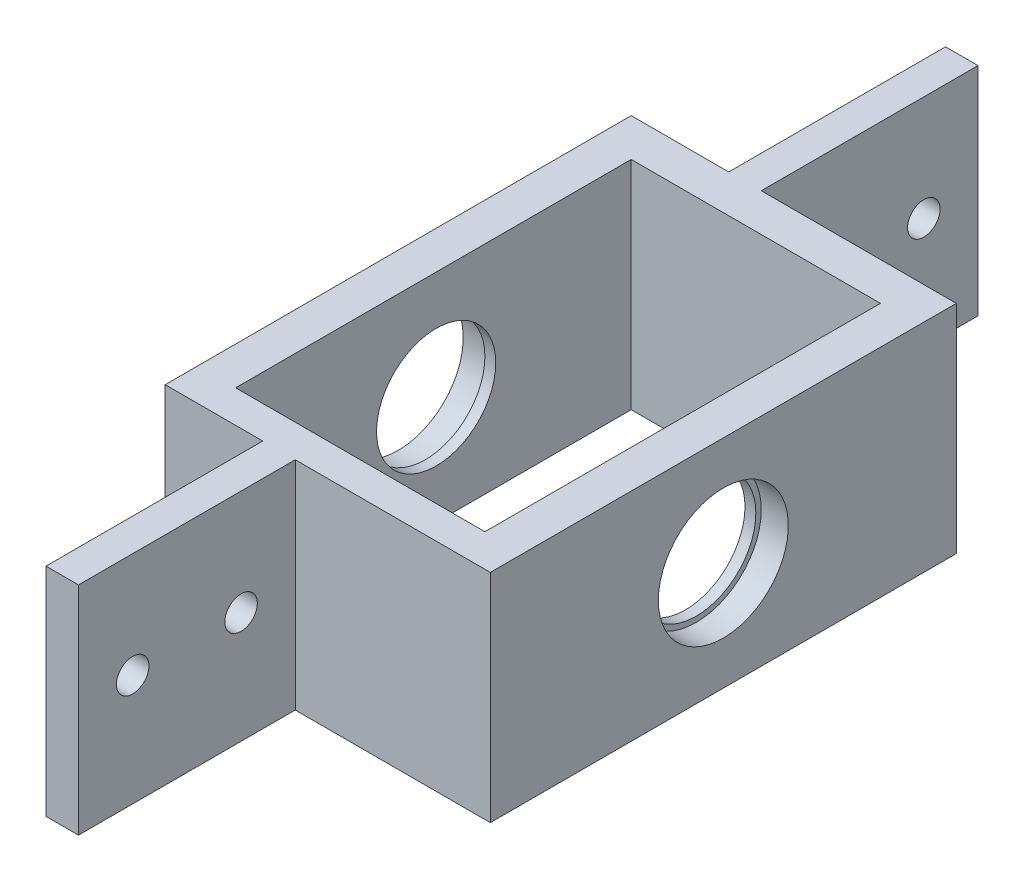
ISO-10303-21;
HEADER;
FILE_DESCRIPTION(('STEP AP214'),'2;1');
FILE_NAME('part.step','',(''),(''),'','','');
FILE_SCHEMA(('AUTOMOTIVE_DESIGN { 1 0 10303 214 1 1 1 1 }'));
ENDSEC;
DATA;
#1=APPLICATION_CONTEXT('core data for automotive mechanical design processes');
#2=APPLICATION_PROTOCOL_DEFINITION('international standard','automotive_design',2000,#1);
#3=PRODUCT_CONTEXT('',#1,'mechanical');
#4=PRODUCT('Part','Part','',(#3));
#5=PRODUCT_RELATED_PRODUCT_CATEGORY('part','',(#4));
#6=PRODUCT_DEFINITION_FORMATION('','',#4);
#7=PRODUCT_DEFINITION_CONTEXT('part definition',#1,'design');
#8=PRODUCT_DEFINITION('design','',#6,#7);
#9=PRODUCT_DEFINITION_SHAPE('','',#8);
#10=(LENGTH_UNIT() NAMED_UNIT(*) SI_UNIT(.MILLI.,.METRE.));
#11=(NAMED_UNIT(*) PLANE_ANGLE_UNIT() SI_UNIT($,.RADIAN.));
#12=(NAMED_UNIT(*) SI_UNIT($,.STERADIAN.) SOLID_ANGLE_UNIT());
#13=UNCERTAINTY_MEASURE_WITH_UNIT(LENGTH_MEASURE(1.E-05),#10,'distance_accuracy_value','');
#14=(GEOMETRIC_REPRESENTATION_CONTEXT(3) GLOBAL_UNCERTAINTY_ASSIGNED_CONTEXT((#13)) GLOBAL_UNIT_ASSIGNED_CONTEXT((#10,
#11,#12)) REPRESENTATION_CONTEXT('',''));
#15=CARTESIAN_POINT('',(0.,0.,0.));
#16=DIRECTION('',(0.,0.,1.));
#17=DIRECTION('',(1.,0.,0.));
#18=AXIS2_PLACEMENT_3D('',#15,#16,#17);
#19=CARTESIAN_POINT('',(0.,0.,3.));
#20=DIRECTION('',(0.,0.,1.));
#21=DIRECTION('',(1.,0.,0.));
#22=AXIS2_PLACEMENT_3D('',#19,#20,#21);
#23=PLANE('',#22);
#24=DIRECTION('',(1.,0.,0.));
#25=VECTOR('',#24,1.);
#26=CARTESIAN_POINT('',(0.,-10.1457513110646,3.));
#27=LINE('',#26,#25);
#28=CARTESIAN_POINT('',(-83.,-10.1457513110646,3.));
#29=VERTEX_POINT('',#28);
#30=CARTESIAN_POINT('',(-74.,-10.1457513110646,3.00000000000001));
#31=VERTEX_POINT('',#30);
#32=EDGE_CURVE('E281',#29,#31,#27,.T.);
#33=ORIENTED_EDGE('',*,*,#32,.T.);
#34=DIRECTION('',(0.,1.,0.));
#35=VECTOR('',#34,1.);
#36=CARTESIAN_POINT('',(-74.,-10.1457513110646,3.00000000000001));
#37=LINE('',#36,#35);
#38=CARTESIAN_POINT('',(-74.,9.85424868893541,3.));
#39=VERTEX_POINT('',#38);
#40=EDGE_CURVE('E167',#31,#39,#37,.T.);
#41=ORIENTED_EDGE('',*,*,#40,.T.);
#42=DIRECTION('',(-1.,0.,0.));
#43=VECTOR('',#42,1.);
#44=CARTESIAN_POINT('',(0.,9.85424868893541,3.));
#45=LINE('',#44,#43);
#46=CARTESIAN_POINT('',(-83.,9.85424868893541,3.));
#47=VERTEX_POINT('',#46);
#48=EDGE_CURVE('E286',#39,#47,#45,.T.);
#49=ORIENTED_EDGE('',*,*,#48,.T.);
#50=DIRECTION('',(0.,1.,0.));
#51=VECTOR('',#50,1.);
#52=CARTESIAN_POINT('',(-83.,0.,3.));
#53=LINE('',#52,#51);
#54=EDGE_CURVE('E290',#29,#47,#53,.T.);
#55=ORIENTED_EDGE('',*,*,#54,.F.);
#56=EDGE_LOOP('',(#33,#41,#49,#55));
#57=FACE_BOUND('',#56,.T.);
#58=ADVANCED_FACE('F37',(#57),#23,.T.);
#59=CARTESIAN_POINT('',(0.,0.,-40.));
#60=DIRECTION('',(0.,0.,1.));
#61=DIRECTION('',(1.,0.,0.));
#62=AXIS2_PLACEMENT_3D('',#59,#60,#61);
#63=PLANE('',#62);
#64=DIRECTION('',(0.,1.,0.));
#65=VECTOR('',#64,1.);
#66=CARTESIAN_POINT('',(-74.,-10.1457513110646,-40.));
#67=LINE('',#66,#65);
#68=CARTESIAN_POINT('',(-74.,-10.1457513110646,-40.));
#69=VERTEX_POINT('',#68);
#70=CARTESIAN_POINT('',(-74.,9.85424868893541,-40.));
#71=VERTEX_POINT('',#70);
#72=EDGE_CURVE('E202',#69,#71,#67,.T.);
#73=ORIENTED_EDGE('',*,*,#72,.F.);
#74=DIRECTION('',(1.,0.,0.));
#75=VECTOR('',#74,1.);
#76=CARTESIAN_POINT('',(0.,-10.1457513110646,-40.));
#77=LINE('',#76,#75);
#78=CARTESIAN_POINT('',(-83.,-10.1457513110646,-40.));
#79=VERTEX_POINT('',#78);
#80=EDGE_CURVE('E268',#79,#69,#77,.T.);
#81=ORIENTED_EDGE('',*,*,#80,.F.);
#82=DIRECTION('',(0.,1.,0.));
#83=VECTOR('',#82,1.);
#84=CARTESIAN_POINT('',(-83.,0.,-40.));
#85=LINE('',#84,#83);
#86=CARTESIAN_POINT('',(-83.,9.85424868893541,-40.));
#87=VERTEX_POINT('',#86);
#88=EDGE_CURVE('E254',#79,#87,#85,.T.);
#89=ORIENTED_EDGE('',*,*,#88,.T.);
#90=DIRECTION('',(-1.,0.,0.));
#91=VECTOR('',#90,1.);
#92=CARTESIAN_POINT('',(0.,9.85424868893541,-40.));
#93=LINE('',#92,#91);
#94=EDGE_CURVE('E267',#71,#87,#93,.T.);
#95=ORIENTED_EDGE('',*,*,#94,.F.);
#96=EDGE_LOOP('',(#73,#81,#89,#95));
#97=FACE_BOUND('',#96,.T.);
#98=ADVANCED_FACE('F338',(#97),#63,.F.);
#99=CARTESIAN_POINT('',(-56.5,0.,-40.));
#100=DIRECTION('',(-1.,0.,0.));
#101=DIRECTION('',(0.,0.,1.));
#102=AXIS2_PLACEMENT_3D('',#99,#100,#101);
#103=PLANE('',#102);
#104=CARTESIAN_POINT('',(-56.5,-0.145751311064588,-18.5));
#105=DIRECTION('',(1.,0.,0.));
#106=DIRECTION('',(0.,0.,-1.));
#107=AXIS2_PLACEMENT_3D('',#104,#105,#106);
#108=CIRCLE('',#107,5.5);
#109=CARTESIAN_POINT('',(-56.5,-0.145751311064588,-24.));
#110=VERTEX_POINT('',#109);
#111=EDGE_CURVE('E236',#110,#110,#108,.T.);
#112=ORIENTED_EDGE('',*,*,#111,.T.);
#113=EDGE_LOOP('',(#112));
#114=FACE_BOUND('',#113,.T.);
#115=DIRECTION('',(0.,0.,1.));
#116=VECTOR('',#115,1.);
#117=CARTESIAN_POINT('',(-56.5,9.85424868893541,-40.));
#118=LINE('',#117,#116);
#119=CARTESIAN_POINT('',(-56.5,9.85424868893541,-36.5));
#120=VERTEX_POINT('',#119);
#121=CARTESIAN_POINT('',(-56.5,9.85424868893541,0.));
#122=VERTEX_POINT('',#121);
#123=EDGE_CURVE('E274',#120,#122,#118,.T.);
#124=ORIENTED_EDGE('',*,*,#123,.F.);
#125=DIRECTION('',(0.,-1.,0.));
#126=VECTOR('',#125,1.);
#127=CARTESIAN_POINT('',(-56.5,9.85424868893541,-36.5));
#128=LINE('',#127,#126);
#129=CARTESIAN_POINT('',(-56.5,-10.1457513110646,-36.5));
#130=VERTEX_POINT('',#129);
#131=EDGE_CURVE('E224',#120,#130,#128,.T.);
#132=ORIENTED_EDGE('',*,*,#131,.T.);
#133=DIRECTION('',(0.,0.,1.));
#134=VECTOR('',#133,1.);
#135=CARTESIAN_POINT('',(-56.5,-10.1457513110646,-40.));
#136=LINE('',#135,#134);
#137=CARTESIAN_POINT('',(-56.5,-10.1457513110646,0.));
#138=VERTEX_POINT('',#137);
#139=EDGE_CURVE('E277',#130,#138,#136,.T.);
#140=ORIENTED_EDGE('',*,*,#139,.T.);
#141=DIRECTION('',(0.,-1.,0.));
#142=VECTOR('',#141,1.);
#143=CARTESIAN_POINT('',(-56.5,0.,0.));
#144=LINE('',#143,#142);
#145=EDGE_CURVE('E262',#122,#138,#144,.T.);
#146=ORIENTED_EDGE('',*,*,#145,.F.);
#147=EDGE_LOOP('',(#124,#132,#140,#146));
#148=FACE_BOUND('',#147,.T.);
#149=ADVANCED_FACE('F365',(#114,#148),#103,.T.);
#150=CARTESIAN_POINT('',(-79.5,0.,-40.));
#151=DIRECTION('',(-1.,0.,0.));
#152=DIRECTION('',(0.,0.,1.));
#153=AXIS2_PLACEMENT_3D('',#150,#151,#152);
#154=PLANE('',#153);
#155=CARTESIAN_POINT('',(-79.5,-0.145751311064588,-18.5));
#156=DIRECTION('',(1.,0.,0.));
#157=DIRECTION('',(0.,0.,-1.));
#158=AXIS2_PLACEMENT_3D('',#155,#156,#157);
#159=CIRCLE('',#158,5.5);
#160=CARTESIAN_POINT('',(-79.5,-0.145751311064588,-24.));
#161=VERTEX_POINT('',#160);
#162=EDGE_CURVE('E232',#161,#161,#159,.T.);
#163=ORIENTED_EDGE('',*,*,#162,.F.);
#164=EDGE_LOOP('',(#163));
#165=FACE_BOUND('',#164,.T.);
#166=DIRECTION('',(0.,-1.,0.));
#167=VECTOR('',#166,1.);
#168=CARTESIAN_POINT('',(-79.5,9.85424868893541,-36.5));
#169=LINE('',#168,#167);
#170=CARTESIAN_POINT('',(-79.5,9.85424868893541,-36.5));
#171=VERTEX_POINT('',#170);
#172=CARTESIAN_POINT('',(-79.5,-10.1457513110646,-36.5));
#173=VERTEX_POINT('',#172);
#174=EDGE_CURVE('E223',#171,#173,#169,.T.);
#175=ORIENTED_EDGE('',*,*,#174,.F.);
#176=DIRECTION('',(0.,0.,1.));
#177=VECTOR('',#176,1.);
#178=CARTESIAN_POINT('',(-79.5,9.85424868893541,-40.));
#179=LINE('',#178,#177);
#180=CARTESIAN_POINT('',(-79.5,9.85424868893541,0.));
#181=VERTEX_POINT('',#180);
#182=EDGE_CURVE('E260',#171,#181,#179,.T.);
#183=ORIENTED_EDGE('',*,*,#182,.T.);
#184=DIRECTION('',(0.,-1.,0.));
#185=VECTOR('',#184,1.);
#186=CARTESIAN_POINT('',(-79.5,0.,0.));
#187=LINE('',#186,#185);
#188=CARTESIAN_POINT('',(-79.5,-10.1457513110646,0.));
#189=VERTEX_POINT('',#188);
#190=EDGE_CURVE('E253',#181,#189,#187,.T.);
#191=ORIENTED_EDGE('',*,*,#190,.T.);
#192=DIRECTION('',(0.,0.,1.));
#193=VECTOR('',#192,1.);
#194=CARTESIAN_POINT('',(-79.5,-10.1457513110646,-40.));
#195=LINE('',#194,#193);
#196=EDGE_CURVE('E257',#173,#189,#195,.T.);
#197=ORIENTED_EDGE('',*,*,#196,.F.);
#198=EDGE_LOOP('',(#175,#183,#191,#197));
#199=FACE_BOUND('',#198,.T.);
#200=ADVANCED_FACE('F370',(#165,#199),#154,.F.);
#201=CARTESIAN_POINT('',(-45.,-0.145751311064588,-18.5));
#202=DIRECTION('',(-1.,0.,0.));
#203=DIRECTION('',(0.,0.,1.));
#204=AXIS2_PLACEMENT_3D('',#201,#202,#203);
#205=CYLINDRICAL_SURFACE('',#204,6.);
#206=CARTESIAN_POINT('',(-83.,-0.145751311064588,-18.5));
#207=DIRECTION('',(-1.,0.,0.));
#208=DIRECTION('',(0.,0.,1.));
#209=AXIS2_PLACEMENT_3D('',#206,#207,#208);
#210=CIRCLE('',#209,6.);
#211=CARTESIAN_POINT('',(-83.,-0.145751311064588,-12.5));
#212=VERTEX_POINT('',#211);
#213=EDGE_CURVE('E247',#212,#212,#210,.T.);
#214=ORIENTED_EDGE('',*,*,#213,.T.);
#215=EDGE_LOOP('',(#214));
#216=FACE_BOUND('',#215,.T.);
#217=CARTESIAN_POINT('',(-80.5,-0.145751311064588,-18.5));
#218=DIRECTION('',(1.,0.,0.));
#219=DIRECTION('',(0.,0.,-1.));
#220=AXIS2_PLACEMENT_3D('',#217,#218,#219);
#221=CIRCLE('',#220,6.);
#222=CARTESIAN_POINT('',(-80.5,-0.145751311064588,-24.5));
#223=VERTEX_POINT('',#222);
#224=EDGE_CURVE('E11',#223,#223,#221,.F.);
#225=ORIENTED_EDGE('',*,*,#224,.F.);
#226=EDGE_LOOP('',(#225));
#227=FACE_BOUND('',#226,.T.);
#228=ADVANCED_FACE('F375',(#216,#227),#205,.F.);
#229=CARTESIAN_POINT('',(0.,0.,0.));
#230=DIRECTION('',(0.,0.,1.));
#231=DIRECTION('',(1.,0.,0.));
#232=AXIS2_PLACEMENT_3D('',#229,#230,#231);
#233=PLANE('',#232);
#234=ORIENTED_EDGE('',*,*,#190,.F.);
#235=DIRECTION('',(-1.,0.,0.));
#236=VECTOR('',#235,1.);
#237=CARTESIAN_POINT('',(0.,9.85424868893541,0.));
#238=LINE('',#237,#236);
#239=EDGE_CURVE('E296',#122,#181,#238,.T.);
#240=ORIENTED_EDGE('',*,*,#239,.F.);
#241=ORIENTED_EDGE('',*,*,#145,.T.);
#242=DIRECTION('',(1.,0.,0.));
#243=VECTOR('',#242,1.);
#244=CARTESIAN_POINT('',(0.,-10.1457513110646,0.));
#245=LINE('',#244,#243);
#246=EDGE_CURVE('E279',#189,#138,#245,.T.);
#247=ORIENTED_EDGE('',*,*,#246,.F.);
#248=EDGE_LOOP('',(#234,#240,#241,#247));
#249=FACE_BOUND('',#248,.T.);
#250=ADVANCED_FACE('F495',(#249),#233,.F.);
#251=CARTESIAN_POINT('',(0.,-10.1457513110646,3.));
#252=DIRECTION('',(0.,1.,0.));
#253=DIRECTION('',(0.,0.,1.));
#254=AXIS2_PLACEMENT_3D('',#251,#252,#253);
#255=PLANE('',#254);
#256=ORIENTED_EDGE('',*,*,#139,.F.);
#257=DIRECTION('',(-1.,0.,0.));
#258=VECTOR('',#257,1.);
#259=CARTESIAN_POINT('',(-56.5,-10.1457513110646,-36.5));
#260=LINE('',#259,#258);
#261=EDGE_CURVE('E226',#130,#173,#260,.T.);
#262=ORIENTED_EDGE('',*,*,#261,.T.);
#263=ORIENTED_EDGE('',*,*,#196,.T.);
#264=ORIENTED_EDGE('',*,*,#246,.T.);
#265=EDGE_LOOP('',(#256,#262,#263,#264));
#266=FACE_BOUND('',#265,.T.);
#267=DIRECTION('',(0.,0.,-1.));
#268=VECTOR('',#267,1.);
#269=CARTESIAN_POINT('',(-83.,-10.1457513110646,3.));
#270=LINE('',#269,#268);
#271=EDGE_CURVE('E293',#29,#79,#270,.T.);
#272=ORIENTED_EDGE('',*,*,#271,.T.);
#273=ORIENTED_EDGE('',*,*,#80,.T.);
#274=DIRECTION('',(0.,0.,1.));
#275=VECTOR('',#274,1.);
#276=CARTESIAN_POINT('',(-74.,-10.1457513110646,-60.));
#277=LINE('',#276,#275);
#278=CARTESIAN_POINT('',(-74.,-10.1457513110646,-60.));
#279=VERTEX_POINT('',#278);
#280=EDGE_CURVE('E199',#279,#69,#277,.T.);
#281=ORIENTED_EDGE('',*,*,#280,.F.);
#282=DIRECTION('',(1.,0.,0.));
#283=VECTOR('',#282,1.);
#284=CARTESIAN_POINT('',(-74.,-10.1457513110646,-60.));
#285=LINE('',#284,#283);
#286=CARTESIAN_POINT('',(-71.,-10.1457513110646,-60.));
#287=VERTEX_POINT('',#286);
#288=EDGE_CURVE('E210',#279,#287,#285,.T.);
#289=ORIENTED_EDGE('',*,*,#288,.T.);
#290=DIRECTION('',(0.,0.,1.));
#291=VECTOR('',#290,1.);
#292=CARTESIAN_POINT('',(-71.,-10.1457513110646,-60.));
#293=LINE('',#292,#291);
#294=CARTESIAN_POINT('',(-71.,-10.1457513110646,-40.));
#295=VERTEX_POINT('',#294);
#296=EDGE_CURVE('E196',#287,#295,#293,.T.);
#297=ORIENTED_EDGE('',*,*,#296,.T.);
#298=CARTESIAN_POINT('',(-53.,-10.1457513110646,-40.));
#299=VERTEX_POINT('',#298);
#300=EDGE_CURVE('E60',#295,#299,#77,.T.);
#301=ORIENTED_EDGE('',*,*,#300,.T.);
#302=DIRECTION('',(0.,0.,-1.));
#303=VECTOR('',#302,1.);
#304=CARTESIAN_POINT('',(-53.,-10.1457513110646,3.));
#305=LINE('',#304,#303);
#306=CARTESIAN_POINT('',(-53.,-10.1457513110646,3.));
#307=VERTEX_POINT('',#306);
#308=EDGE_CURVE('E45',#307,#299,#305,.T.);
#309=ORIENTED_EDGE('',*,*,#308,.F.);
#310=CARTESIAN_POINT('',(-71.,-10.1457513110646,3.00000000000001));
#311=VERTEX_POINT('',#310);
#312=EDGE_CURVE('E284',#311,#307,#27,.T.);
#313=ORIENTED_EDGE('',*,*,#312,.F.);
#314=DIRECTION('',(0.,0.,-1.));
#315=VECTOR('',#314,1.);
#316=CARTESIAN_POINT('',(-71.,-10.1457513110646,23.));
#317=LINE('',#316,#315);
#318=CARTESIAN_POINT('',(-71.,-10.1457513110646,23.));
#319=VERTEX_POINT('',#318);
#320=EDGE_CURVE('E157',#319,#311,#317,.T.);
#321=ORIENTED_EDGE('',*,*,#320,.F.);
#322=DIRECTION('',(1.,0.,0.));
#323=VECTOR('',#322,1.);
#324=CARTESIAN_POINT('',(-74.,-10.1457513110646,23.));
#325=LINE('',#324,#323);
#326=CARTESIAN_POINT('',(-74.,-10.1457513110646,23.));
#327=VERTEX_POINT('',#326);
#328=EDGE_CURVE('E151',#327,#319,#325,.T.);
#329=ORIENTED_EDGE('',*,*,#328,.F.);
#330=DIRECTION('',(0.,0.,-1.));
#331=VECTOR('',#330,1.);
#332=CARTESIAN_POINT('',(-74.,-10.1457513110646,23.));
#333=LINE('',#332,#331);
#334=EDGE_CURVE('E155',#327,#31,#333,.T.);
#335=ORIENTED_EDGE('',*,*,#334,.T.);
#336=ORIENTED_EDGE('',*,*,#32,.F.);
#337=EDGE_LOOP('',(#272,#273,#281,#289,#297,#301,#309,#313,#321,#329,#335,#336));
#338=FACE_BOUND('',#337,.T.);
#339=ADVANCED_FACE('F39',(#266,#338),#255,.F.);
#340=CARTESIAN_POINT('',(-53.,0.,3.));
#341=DIRECTION('',(-1.,0.,0.));
#342=DIRECTION('',(0.,0.,1.));
#343=AXIS2_PLACEMENT_3D('',#340,#341,#342);
#344=PLANE('',#343);
#345=CARTESIAN_POINT('',(-53.,-0.145751311064588,-18.5));
#346=DIRECTION('',(-1.,0.,0.));
#347=DIRECTION('',(0.,0.,1.));
#348=AXIS2_PLACEMENT_3D('',#345,#346,#347);
#349=CIRCLE('',#348,6.);
#350=CARTESIAN_POINT('',(-53.,-0.145751311064588,-12.5));
#351=VERTEX_POINT('',#350);
#352=EDGE_CURVE('E250',#351,#351,#349,.T.);
#353=ORIENTED_EDGE('',*,*,#352,.T.);
#354=EDGE_LOOP('',(#353));
#355=FACE_BOUND('',#354,.T.);
#356=ORIENTED_EDGE('',*,*,#308,.T.);
#357=DIRECTION('',(0.,1.,0.));
#358=VECTOR('',#357,1.);
#359=CARTESIAN_POINT('',(-53.,0.,-40.));
#360=LINE('',#359,#358);
#361=CARTESIAN_POINT('',(-53.,9.85424868893541,-40.));
#362=VERTEX_POINT('',#361);
#363=EDGE_CURVE('E271',#299,#362,#360,.T.);
#364=ORIENTED_EDGE('',*,*,#363,.T.);
#365=DIRECTION('',(0.,0.,-1.));
#366=VECTOR('',#365,1.);
#367=CARTESIAN_POINT('',(-53.,9.85424868893541,3.));
#368=LINE('',#367,#366);
#369=CARTESIAN_POINT('',(-53.,9.85424868893541,3.));
#370=VERTEX_POINT('',#369);
#371=EDGE_CURVE('E303',#370,#362,#368,.T.);
#372=ORIENTED_EDGE('',*,*,#371,.F.);
#373=DIRECTION('',(0.,1.,0.));
#374=VECTOR('',#373,1.);
#375=CARTESIAN_POINT('',(-53.,0.,3.));
#376=LINE('',#375,#374);
#377=EDGE_CURVE('E283',#307,#370,#376,.T.);
#378=ORIENTED_EDGE('',*,*,#377,.F.);
#379=EDGE_LOOP('',(#356,#364,#372,#378));
#380=FACE_BOUND('',#379,.T.);
#381=ADVANCED_FACE('F308',(#355,#380),#344,.F.);
#382=CARTESIAN_POINT('',(0.,9.85424868893541,3.));
#383=DIRECTION('',(0.,-1.,0.));
#384=DIRECTION('',(0.,0.,-1.));
#385=AXIS2_PLACEMENT_3D('',#382,#383,#384);
#386=PLANE('',#385);
#387=DIRECTION('',(-1.,0.,0.));
#388=VECTOR('',#387,1.);
#389=CARTESIAN_POINT('',(-56.5,9.85424868893541,-36.5));
#390=LINE('',#389,#388);
#391=EDGE_CURVE('E230',#120,#171,#390,.T.);
#392=ORIENTED_EDGE('',*,*,#391,.F.);
#393=ORIENTED_EDGE('',*,*,#123,.T.);
#394=ORIENTED_EDGE('',*,*,#239,.T.);
#395=ORIENTED_EDGE('',*,*,#182,.F.);
#396=EDGE_LOOP('',(#392,#393,#394,#395));
#397=FACE_BOUND('',#396,.T.);
#398=ORIENTED_EDGE('',*,*,#371,.T.);
#399=CARTESIAN_POINT('',(-71.,9.85424868893541,-40.));
#400=VERTEX_POINT('',#399);
#401=EDGE_CURVE('E264',#362,#400,#93,.T.);
#402=ORIENTED_EDGE('',*,*,#401,.T.);
#403=DIRECTION('',(0.,0.,-1.));
#404=VECTOR('',#403,1.);
#405=CARTESIAN_POINT('',(-71.,9.85424868893541,-40.));
#406=LINE('',#405,#404);
#407=CARTESIAN_POINT('',(-71.,9.85424868893541,-60.));
#408=VERTEX_POINT('',#407);
#409=EDGE_CURVE('E215',#400,#408,#406,.T.);
#410=ORIENTED_EDGE('',*,*,#409,.T.);
#411=DIRECTION('',(1.,0.,0.));
#412=VECTOR('',#411,1.);
#413=CARTESIAN_POINT('',(-74.,9.85424868893541,-60.));
#414=LINE('',#413,#412);
#415=CARTESIAN_POINT('',(-74.,9.85424868893541,-60.));
#416=VERTEX_POINT('',#415);
#417=EDGE_CURVE('E220',#416,#408,#414,.T.);
#418=ORIENTED_EDGE('',*,*,#417,.F.);
#419=DIRECTION('',(0.,0.,-1.));
#420=VECTOR('',#419,1.);
#421=CARTESIAN_POINT('',(-74.,9.85424868893541,-40.));
#422=LINE('',#421,#420);
#423=EDGE_CURVE('E206',#71,#416,#422,.T.);
#424=ORIENTED_EDGE('',*,*,#423,.F.);
#425=ORIENTED_EDGE('',*,*,#94,.T.);
#426=DIRECTION('',(0.,0.,-1.));
#427=VECTOR('',#426,1.);
#428=CARTESIAN_POINT('',(-83.,9.85424868893541,3.));
#429=LINE('',#428,#427);
#430=EDGE_CURVE('E300',#47,#87,#429,.T.);
#431=ORIENTED_EDGE('',*,*,#430,.F.);
#432=ORIENTED_EDGE('',*,*,#48,.F.);
#433=DIRECTION('',(0.,0.,1.));
#434=VECTOR('',#433,1.);
#435=CARTESIAN_POINT('',(-74.,9.85424868893541,3.00000000000001));
#436=LINE('',#435,#434);
#437=CARTESIAN_POINT('',(-74.,9.85424868893541,23.));
#438=VERTEX_POINT('',#437);
#439=EDGE_CURVE('E52',#39,#438,#436,.T.);
#440=ORIENTED_EDGE('',*,*,#439,.T.);
#441=DIRECTION('',(1.,0.,0.));
#442=VECTOR('',#441,1.);
#443=CARTESIAN_POINT('',(-74.,9.85424868893541,23.));
#444=LINE('',#443,#442);
#445=CARTESIAN_POINT('',(-71.,9.85424868893541,23.));
#446=VERTEX_POINT('',#445);
#447=EDGE_CURVE('E163',#438,#446,#444,.T.);
#448=ORIENTED_EDGE('',*,*,#447,.T.);
#449=DIRECTION('',(0.,0.,1.));
#450=VECTOR('',#449,1.);
#451=CARTESIAN_POINT('',(-71.,9.85424868893541,3.00000000000001));
#452=LINE('',#451,#450);
#453=CARTESIAN_POINT('',(-71.,9.85424868893541,3.00000000000001));
#454=VERTEX_POINT('',#453);
#455=EDGE_CURVE('E181',#454,#446,#452,.T.);
#456=ORIENTED_EDGE('',*,*,#455,.F.);
#457=EDGE_CURVE('E287',#370,#454,#45,.T.);
#458=ORIENTED_EDGE('',*,*,#457,.F.);
#459=EDGE_LOOP('',(#398,#402,#410,#418,#424,#425,#431,#432,#440,#448,#456,#458));
#460=FACE_BOUND('',#459,.T.);
#461=ADVANCED_FACE('F314',(#397,#460),#386,.F.);
#462=CARTESIAN_POINT('',(-83.,0.,3.));
#463=DIRECTION('',(-1.,0.,0.));
#464=DIRECTION('',(0.,0.,1.));
#465=AXIS2_PLACEMENT_3D('',#462,#463,#464);
#466=PLANE('',#465);
#467=ORIENTED_EDGE('',*,*,#213,.F.);
#468=EDGE_LOOP('',(#467));
#469=FACE_BOUND('',#468,.T.);
#470=ORIENTED_EDGE('',*,*,#430,.T.);
#471=ORIENTED_EDGE('',*,*,#88,.F.);
#472=ORIENTED_EDGE('',*,*,#271,.F.);
#473=ORIENTED_EDGE('',*,*,#54,.T.);
#474=EDGE_LOOP('',(#470,#471,#472,#473));
#475=FACE_BOUND('',#474,.T.);
#476=ADVANCED_FACE('F336',(#469,#475),#466,.T.);
#477=DIRECTION('',(0.,1.,0.));
#478=VECTOR('',#477,1.);
#479=CARTESIAN_POINT('',(-71.,-10.1457513110646,3.00000000000001));
#480=LINE('',#479,#478);
#481=EDGE_CURVE('E169',#311,#454,#480,.T.);
#482=ORIENTED_EDGE('',*,*,#481,.F.);
#483=ORIENTED_EDGE('',*,*,#312,.T.);
#484=ORIENTED_EDGE('',*,*,#377,.T.);
#485=ORIENTED_EDGE('',*,*,#457,.T.);
#486=EDGE_LOOP('',(#482,#483,#484,#485));
#487=FACE_BOUND('',#486,.T.);
#488=ADVANCED_FACE('F344',(#487),#23,.T.);
#489=ORIENTED_EDGE('',*,*,#300,.F.);
#490=DIRECTION('',(0.,1.,0.));
#491=VECTOR('',#490,1.);
#492=CARTESIAN_POINT('',(-71.,-10.1457513110646,-40.));
#493=LINE('',#492,#491);
#494=EDGE_CURVE('E213',#295,#400,#493,.T.);
#495=ORIENTED_EDGE('',*,*,#494,.T.);
#496=ORIENTED_EDGE('',*,*,#401,.F.);
#497=ORIENTED_EDGE('',*,*,#363,.F.);
#498=EDGE_LOOP('',(#489,#495,#496,#497));
#499=FACE_BOUND('',#498,.T.);
#500=ADVANCED_FACE('F311',(#499),#63,.F.);
#501=CARTESIAN_POINT('',(-55.5,-0.145751311064588,-18.5));
#502=DIRECTION('',(1.,0.,0.));
#503=DIRECTION('',(0.,0.,-1.));
#504=AXIS2_PLACEMENT_3D('',#501,#502,#503);
#505=CIRCLE('',#504,6.);
#506=CARTESIAN_POINT('',(-55.5,-0.145751311064588,-24.5));
#507=VERTEX_POINT('',#506);
#508=EDGE_CURVE('E242',#507,#507,#505,.T.);
#509=ORIENTED_EDGE('',*,*,#508,.F.);
#510=EDGE_LOOP('',(#509));
#511=FACE_BOUND('',#510,.T.);
#512=ORIENTED_EDGE('',*,*,#352,.F.);
#513=EDGE_LOOP('',(#512));
#514=FACE_BOUND('',#513,.T.);
#515=ADVANCED_FACE('F352',(#511,#514),#205,.F.);
#516=CARTESIAN_POINT('',(-55.5,-0.145751311064588,-18.5));
#517=DIRECTION('',(1.,0.,0.));
#518=DIRECTION('',(0.,0.,-1.));
#519=AXIS2_PLACEMENT_3D('',#516,#517,#518);
#520=PLANE('',#519);
#521=ORIENTED_EDGE('',*,*,#508,.T.);
#522=EDGE_LOOP('',(#521));
#523=FACE_BOUND('',#522,.T.);
#524=CARTESIAN_POINT('',(-55.5,-0.145751311064588,-18.5));
#525=DIRECTION('',(1.,0.,0.));
#526=DIRECTION('',(0.,0.,-1.));
#527=AXIS2_PLACEMENT_3D('',#524,#525,#526);
#528=CIRCLE('',#527,5.5);
#529=CARTESIAN_POINT('',(-55.5,-0.145751311064588,-24.));
#530=VERTEX_POINT('',#529);
#531=EDGE_CURVE('E239',#530,#530,#528,.T.);
#532=ORIENTED_EDGE('',*,*,#531,.F.);
#533=EDGE_LOOP('',(#532));
#534=FACE_BOUND('',#533,.T.);
#535=ADVANCED_FACE('F379',(#523,#534),#520,.T.);
#536=CARTESIAN_POINT('',(-55.5,-0.145751311064588,-18.5));
#537=DIRECTION('',(-1.,0.,0.));
#538=DIRECTION('',(0.,0.,1.));
#539=AXIS2_PLACEMENT_3D('',#536,#537,#538);
#540=CYLINDRICAL_SURFACE('',#539,5.5);
#541=ORIENTED_EDGE('',*,*,#531,.T.);
#542=EDGE_LOOP('',(#541));
#543=FACE_BOUND('',#542,.T.);
#544=ORIENTED_EDGE('',*,*,#111,.F.);
#545=EDGE_LOOP('',(#544));
#546=FACE_BOUND('',#545,.T.);
#547=ADVANCED_FACE('F383',(#543,#546),#540,.F.);
#548=CARTESIAN_POINT('',(-80.5,-0.145751311064588,-18.5));
#549=DIRECTION('',(1.,0.,0.));
#550=DIRECTION('',(0.,0.,-1.));
#551=AXIS2_PLACEMENT_3D('',#548,#549,#550);
#552=PLANE('',#551);
#553=CARTESIAN_POINT('',(-80.5,-0.145751311064588,-18.5));
#554=DIRECTION('',(1.,0.,0.));
#555=DIRECTION('',(0.,0.,-1.));
#556=AXIS2_PLACEMENT_3D('',#553,#554,#555);
#557=CIRCLE('',#556,5.5);
#558=CARTESIAN_POINT('',(-80.5,-0.145751311064588,-24.));
#559=VERTEX_POINT('',#558);
#560=EDGE_CURVE('E233',#559,#559,#557,.T.);
#561=ORIENTED_EDGE('',*,*,#560,.T.);
#562=EDGE_LOOP('',(#561));
#563=FACE_BOUND('',#562,.T.);
#564=ORIENTED_EDGE('',*,*,#224,.T.);
#565=EDGE_LOOP('',(#564));
#566=FACE_BOUND('',#565,.T.);
#567=ADVANCED_FACE('F387',(#563,#566),#552,.F.);
#568=CARTESIAN_POINT('',(-80.5,-0.145751311064588,-18.5));
#569=DIRECTION('',(1.,0.,0.));
#570=DIRECTION('',(0.,0.,-1.));
#571=AXIS2_PLACEMENT_3D('',#568,#569,#570);
#572=CYLINDRICAL_SURFACE('',#571,5.5);
#573=ORIENTED_EDGE('',*,*,#560,.F.);
#574=EDGE_LOOP('',(#573));
#575=FACE_BOUND('',#574,.T.);
#576=ORIENTED_EDGE('',*,*,#162,.T.);
#577=EDGE_LOOP('',(#576));
#578=FACE_BOUND('',#577,.T.);
#579=ADVANCED_FACE('F391',(#575,#578),#572,.F.);
#580=CARTESIAN_POINT('',(-56.5,9.85424868893541,-36.5));
#581=DIRECTION('',(0.,0.,-1.));
#582=DIRECTION('',(-1.,0.,0.));
#583=AXIS2_PLACEMENT_3D('',#580,#581,#582);
#584=PLANE('',#583);
#585=ORIENTED_EDGE('',*,*,#174,.T.);
#586=ORIENTED_EDGE('',*,*,#261,.F.);
#587=ORIENTED_EDGE('',*,*,#131,.F.);
#588=ORIENTED_EDGE('',*,*,#391,.T.);
#589=EDGE_LOOP('',(#585,#586,#587,#588));
#590=FACE_BOUND('',#589,.T.);
#591=ADVANCED_FACE('F395',(#590),#584,.F.);
#592=CARTESIAN_POINT('',(-74.,0.,0.));
#593=DIRECTION('',(-1.,0.,0.));
#594=DIRECTION('',(0.,0.,1.));
#595=AXIS2_PLACEMENT_3D('',#592,#593,#594);
#596=PLANE('',#595);
#597=CARTESIAN_POINT('',(-74.,0.14424868893541,-55.));
#598=DIRECTION('',(-1.,0.,0.));
#599=DIRECTION('',(0.,0.,1.));
#600=AXIS2_PLACEMENT_3D('',#597,#598,#599);
#601=CIRCLE('',#600,1.5);
#602=CARTESIAN_POINT('',(-74.,0.14424868893541,-53.5));
#603=VERTEX_POINT('',#602);
#604=EDGE_CURVE('E193',#603,#603,#601,.T.);
#605=ORIENTED_EDGE('',*,*,#604,.F.);
#606=EDGE_LOOP('',(#605));
#607=FACE_BOUND('',#606,.T.);
#608=ORIENTED_EDGE('',*,*,#280,.T.);
#609=ORIENTED_EDGE('',*,*,#72,.T.);
#610=ORIENTED_EDGE('',*,*,#423,.T.);
#611=DIRECTION('',(0.,-1.,0.));
#612=VECTOR('',#611,1.);
#613=CARTESIAN_POINT('',(-74.,9.85424868893541,-60.));
#614=LINE('',#613,#612);
#615=EDGE_CURVE('E208',#416,#279,#614,.T.);
#616=ORIENTED_EDGE('',*,*,#615,.T.);
#617=EDGE_LOOP('',(#608,#609,#610,#616));
#618=FACE_BOUND('',#617,.T.);
#619=CARTESIAN_POINT('',(-74.,0.14424868893541,-45.));
#620=DIRECTION('',(-1.,0.,0.));
#621=DIRECTION('',(0.,0.,1.));
#622=AXIS2_PLACEMENT_3D('',#619,#620,#621);
#623=CIRCLE('',#622,1.5);
#624=CARTESIAN_POINT('',(-74.,0.14424868893541,-43.5));
#625=VERTEX_POINT('',#624);
#626=EDGE_CURVE('E187',#625,#625,#623,.T.);
#627=ORIENTED_EDGE('',*,*,#626,.F.);
#628=EDGE_LOOP('',(#627));
#629=FACE_BOUND('',#628,.T.);
#630=ADVANCED_FACE('F328',(#607,#618,#629),#596,.T.);
#631=CARTESIAN_POINT('',(-71.,0.,0.));
#632=DIRECTION('',(-1.,0.,0.));
#633=DIRECTION('',(0.,0.,1.));
#634=AXIS2_PLACEMENT_3D('',#631,#632,#633);
#635=PLANE('',#634);
#636=ORIENTED_EDGE('',*,*,#296,.F.);
#637=DIRECTION('',(0.,-1.,0.));
#638=VECTOR('',#637,1.);
#639=CARTESIAN_POINT('',(-71.,9.85424868893541,-60.));
#640=LINE('',#639,#638);
#641=EDGE_CURVE('E203',#408,#287,#640,.T.);
#642=ORIENTED_EDGE('',*,*,#641,.F.);
#643=ORIENTED_EDGE('',*,*,#409,.F.);
#644=ORIENTED_EDGE('',*,*,#494,.F.);
#645=EDGE_LOOP('',(#636,#642,#643,#644));
#646=FACE_BOUND('',#645,.T.);
#647=CARTESIAN_POINT('',(-71.,0.14424868893541,-55.));
#648=DIRECTION('',(-1.,0.,0.));
#649=DIRECTION('',(0.,0.,1.));
#650=AXIS2_PLACEMENT_3D('',#647,#648,#649);
#651=CIRCLE('',#650,1.5);
#652=CARTESIAN_POINT('',(-71.,0.14424868893541,-53.5));
#653=VERTEX_POINT('',#652);
#654=EDGE_CURVE('E190',#653,#653,#651,.T.);
#655=ORIENTED_EDGE('',*,*,#654,.T.);
#656=EDGE_LOOP('',(#655));
#657=FACE_BOUND('',#656,.T.);
#658=CARTESIAN_POINT('',(-71.,0.14424868893541,-45.));
#659=DIRECTION('',(-1.,0.,0.));
#660=DIRECTION('',(0.,0.,1.));
#661=AXIS2_PLACEMENT_3D('',#658,#659,#660);
#662=CIRCLE('',#661,1.5);
#663=CARTESIAN_POINT('',(-71.,0.14424868893541,-43.5));
#664=VERTEX_POINT('',#663);
#665=EDGE_CURVE('E162',#664,#664,#662,.T.);
#666=ORIENTED_EDGE('',*,*,#665,.T.);
#667=EDGE_LOOP('',(#666));
#668=FACE_BOUND('',#667,.T.);
#669=ADVANCED_FACE('F320',(#646,#657,#668),#635,.F.);
#670=CARTESIAN_POINT('',(-74.,9.85424868893541,-60.));
#671=DIRECTION('',(0.,0.,1.));
#672=DIRECTION('',(1.,0.,0.));
#673=AXIS2_PLACEMENT_3D('',#670,#671,#672);
#674=PLANE('',#673);
#675=ORIENTED_EDGE('',*,*,#641,.T.);
#676=ORIENTED_EDGE('',*,*,#288,.F.);
#677=ORIENTED_EDGE('',*,*,#615,.F.);
#678=ORIENTED_EDGE('',*,*,#417,.T.);
#679=EDGE_LOOP('',(#675,#676,#677,#678));
#680=FACE_BOUND('',#679,.T.);
#681=ADVANCED_FACE('F324',(#680),#674,.F.);
#682=CARTESIAN_POINT('',(-74.,0.14424868893541,-55.));
#683=DIRECTION('',(1.,0.,0.));
#684=DIRECTION('',(0.,0.,-1.));
#685=AXIS2_PLACEMENT_3D('',#682,#683,#684);
#686=CYLINDRICAL_SURFACE('',#685,1.5);
#687=ORIENTED_EDGE('',*,*,#604,.T.);
#688=EDGE_LOOP('',(#687));
#689=FACE_BOUND('',#688,.T.);
#690=ORIENTED_EDGE('',*,*,#654,.F.);
#691=EDGE_LOOP('',(#690));
#692=FACE_BOUND('',#691,.T.);
#693=ADVANCED_FACE('F402',(#689,#692),#686,.F.);
#694=CARTESIAN_POINT('',(-74.,0.14424868893541,-45.));
#695=DIRECTION('',(1.,0.,0.));
#696=DIRECTION('',(0.,0.,-1.));
#697=AXIS2_PLACEMENT_3D('',#694,#695,#696);
#698=CYLINDRICAL_SURFACE('',#697,1.5);
#699=ORIENTED_EDGE('',*,*,#626,.T.);
#700=EDGE_LOOP('',(#699));
#701=FACE_BOUND('',#700,.T.);
#702=ORIENTED_EDGE('',*,*,#665,.F.);
#703=EDGE_LOOP('',(#702));
#704=FACE_BOUND('',#703,.T.);
#705=ADVANCED_FACE('F410',(#701,#704),#698,.F.);
#706=CARTESIAN_POINT('',(-74.,9.85424868893541,23.));
#707=DIRECTION('',(0.,0.,1.));
#708=DIRECTION('',(1.,0.,0.));
#709=AXIS2_PLACEMENT_3D('',#706,#707,#708);
#710=PLANE('',#709);
#711=DIRECTION('',(0.,-1.,0.));
#712=VECTOR('',#711,1.);
#713=CARTESIAN_POINT('',(-71.,9.85424868893541,23.));
#714=LINE('',#713,#712);
#715=EDGE_CURVE('E178',#446,#319,#714,.T.);
#716=ORIENTED_EDGE('',*,*,#715,.F.);
#717=ORIENTED_EDGE('',*,*,#447,.F.);
#718=DIRECTION('',(0.,-1.,0.));
#719=VECTOR('',#718,1.);
#720=CARTESIAN_POINT('',(-74.,9.85424868893541,23.));
#721=LINE('',#720,#719);
#722=EDGE_CURVE('E166',#438,#327,#721,.T.);
#723=ORIENTED_EDGE('',*,*,#722,.T.);
#724=ORIENTED_EDGE('',*,*,#328,.T.);
#725=EDGE_LOOP('',(#716,#717,#723,#724));
#726=FACE_BOUND('',#725,.T.);
#727=ADVANCED_FACE('F171',(#726),#710,.T.);
#728=CARTESIAN_POINT('',(-74.,0.,-37.));
#729=DIRECTION('',(-1.,0.,0.));
#730=DIRECTION('',(0.,0.,-1.));
#731=AXIS2_PLACEMENT_3D('',#728,#729,#730);
#732=PLANE('',#731);
#733=CARTESIAN_POINT('',(-74.,0.14424868893541,8.00000000000001));
#734=DIRECTION('',(1.,0.,0.));
#735=DIRECTION('',(0.,0.,-1.));
#736=AXIS2_PLACEMENT_3D('',#733,#734,#735);
#737=CIRCLE('',#736,1.5);
#738=CARTESIAN_POINT('',(-74.,0.14424868893541,6.5));
#739=VERTEX_POINT('',#738);
#740=EDGE_CURVE('E435',#739,#739,#737,.T.);
#741=ORIENTED_EDGE('',*,*,#740,.T.);
#742=EDGE_LOOP('',(#741));
#743=FACE_BOUND('',#742,.T.);
#744=CARTESIAN_POINT('',(-74.,0.14424868893541,18.));
#745=DIRECTION('',(1.,0.,0.));
#746=DIRECTION('',(0.,0.,-1.));
#747=AXIS2_PLACEMENT_3D('',#744,#745,#746);
#748=CIRCLE('',#747,1.5);
#749=CARTESIAN_POINT('',(-74.,0.14424868893541,16.5));
#750=VERTEX_POINT('',#749);
#751=EDGE_CURVE('E179',#750,#750,#748,.T.);
#752=ORIENTED_EDGE('',*,*,#751,.T.);
#753=EDGE_LOOP('',(#752));
#754=FACE_BOUND('',#753,.T.);
#755=ORIENTED_EDGE('',*,*,#334,.F.);
#756=ORIENTED_EDGE('',*,*,#722,.F.);
#757=ORIENTED_EDGE('',*,*,#439,.F.);
#758=ORIENTED_EDGE('',*,*,#40,.F.);
#759=EDGE_LOOP('',(#755,#756,#757,#758));
#760=FACE_BOUND('',#759,.T.);
#761=ADVANCED_FACE('F165',(#743,#754,#760),#732,.T.);
#762=CARTESIAN_POINT('',(-71.,0.,-37.));
#763=DIRECTION('',(-1.,0.,0.));
#764=DIRECTION('',(0.,0.,-1.));
#765=AXIS2_PLACEMENT_3D('',#762,#763,#764);
#766=PLANE('',#765);
#767=CARTESIAN_POINT('',(-71.,0.14424868893541,8.00000000000001));
#768=DIRECTION('',(1.,0.,0.));
#769=DIRECTION('',(0.,0.,-1.));
#770=AXIS2_PLACEMENT_3D('',#767,#768,#769);
#771=CIRCLE('',#770,1.5);
#772=CARTESIAN_POINT('',(-71.,0.14424868893541,6.5));
#773=VERTEX_POINT('',#772);
#774=EDGE_CURVE('E438',#773,#773,#771,.T.);
#775=ORIENTED_EDGE('',*,*,#774,.F.);
#776=EDGE_LOOP('',(#775));
#777=FACE_BOUND('',#776,.T.);
#778=CARTESIAN_POINT('',(-71.,0.14424868893541,18.));
#779=DIRECTION('',(1.,0.,0.));
#780=DIRECTION('',(0.,0.,-1.));
#781=AXIS2_PLACEMENT_3D('',#778,#779,#780);
#782=CIRCLE('',#781,1.5);
#783=CARTESIAN_POINT('',(-71.,0.14424868893541,16.5));
#784=VERTEX_POINT('',#783);
#785=EDGE_CURVE('E440',#784,#784,#782,.T.);
#786=ORIENTED_EDGE('',*,*,#785,.F.);
#787=EDGE_LOOP('',(#786));
#788=FACE_BOUND('',#787,.T.);
#789=ORIENTED_EDGE('',*,*,#320,.T.);
#790=ORIENTED_EDGE('',*,*,#481,.T.);
#791=ORIENTED_EDGE('',*,*,#455,.T.);
#792=ORIENTED_EDGE('',*,*,#715,.T.);
#793=EDGE_LOOP('',(#789,#790,#791,#792));
#794=FACE_BOUND('',#793,.T.);
#795=ADVANCED_FACE('F341',(#777,#788,#794),#766,.F.);
#796=CARTESIAN_POINT('',(-74.,0.14424868893541,18.));
#797=DIRECTION('',(1.,0.,0.));
#798=DIRECTION('',(0.,0.,-1.));
#799=AXIS2_PLACEMENT_3D('',#796,#797,#798);
#800=CYLINDRICAL_SURFACE('',#799,1.5);
#801=ORIENTED_EDGE('',*,*,#751,.F.);
#802=EDGE_LOOP('',(#801));
#803=FACE_BOUND('',#802,.T.);
#804=ORIENTED_EDGE('',*,*,#785,.T.);
#805=EDGE_LOOP('',(#804));
#806=FACE_BOUND('',#805,.T.);
#807=ADVANCED_FACE('F419',(#803,#806),#800,.F.);
#808=CARTESIAN_POINT('',(-74.,0.14424868893541,8.00000000000001));
#809=DIRECTION('',(1.,0.,0.));
#810=DIRECTION('',(0.,0.,-1.));
#811=AXIS2_PLACEMENT_3D('',#808,#809,#810);
#812=CYLINDRICAL_SURFACE('',#811,1.5);
#813=ORIENTED_EDGE('',*,*,#740,.F.);
#814=EDGE_LOOP('',(#813));
#815=FACE_BOUND('',#814,.T.);
#816=ORIENTED_EDGE('',*,*,#774,.T.);
#817=EDGE_LOOP('',(#816));
#818=FACE_BOUND('',#817,.T.);
#819=ADVANCED_FACE('F426',(#815,#818),#812,.F.);
#820=CLOSED_SHELL('',(#58,#98,#149,#200,#228,#250,#339,#381,#461,#476,#488,#500,#515,#535,#547,
#567,#579,#591,#630,#669,#681,#693,#705,#727,#761,#795,#807,#819));
#821=MANIFOLD_SOLID_BREP('B2',#820);
#822=ADVANCED_BREP_SHAPE_REPRESENTATION('',(#18,#821),#14);
#823=SHAPE_DEFINITION_REPRESENTATION(#9,#822);
ENDSEC;
END-ISO-10303-21;
